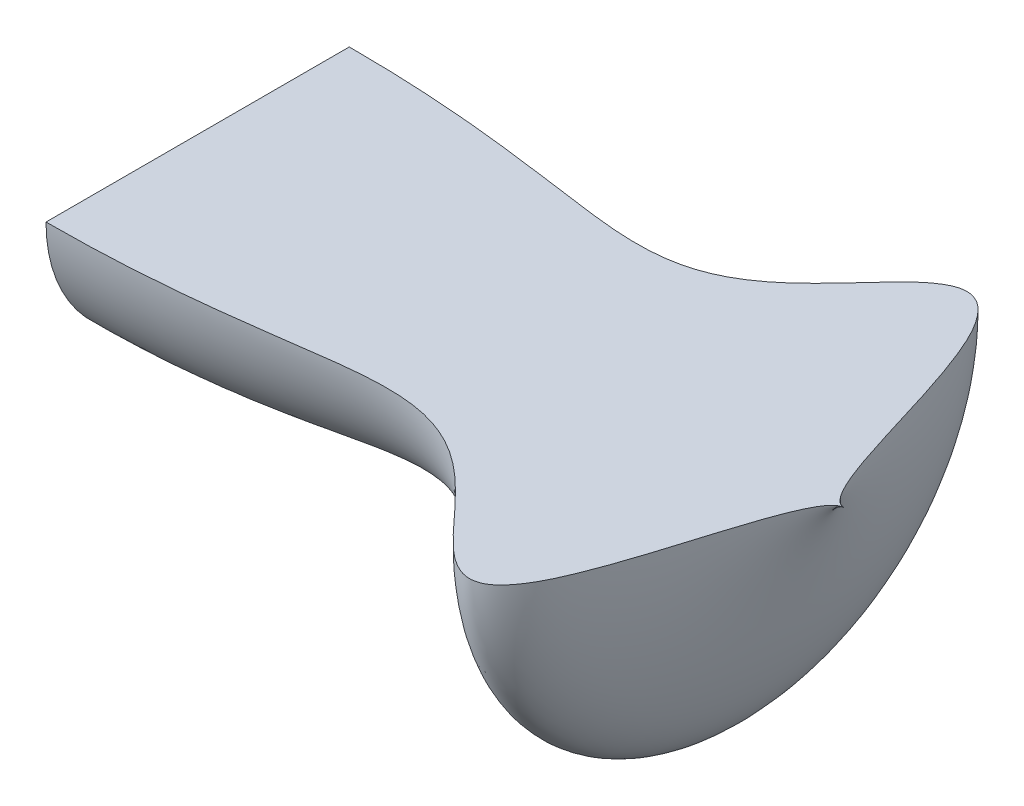
ISO-10303-21;
HEADER;
FILE_DESCRIPTION(('STEP AP214'),'2;1');
FILE_NAME('part.step','',(''),(''),'','','');
FILE_SCHEMA(('AUTOMOTIVE_DESIGN { 1 0 10303 214 1 1 1 1 }'));
ENDSEC;
DATA;
#1=APPLICATION_CONTEXT('core data for automotive mechanical design processes');
#2=APPLICATION_PROTOCOL_DEFINITION('international standard','automotive_design',2000,#1);
#3=PRODUCT_CONTEXT('',#1,'mechanical');
#4=PRODUCT('Part','Part','',(#3));
#5=PRODUCT_RELATED_PRODUCT_CATEGORY('part','',(#4));
#6=PRODUCT_DEFINITION_FORMATION('','',#4);
#7=PRODUCT_DEFINITION_CONTEXT('part definition',#1,'design');
#8=PRODUCT_DEFINITION('design','',#6,#7);
#9=PRODUCT_DEFINITION_SHAPE('','',#8);
#10=(LENGTH_UNIT() NAMED_UNIT(*) SI_UNIT(.MILLI.,.METRE.));
#11=(NAMED_UNIT(*) PLANE_ANGLE_UNIT() SI_UNIT($,.RADIAN.));
#12=(NAMED_UNIT(*) SI_UNIT($,.STERADIAN.) SOLID_ANGLE_UNIT());
#13=UNCERTAINTY_MEASURE_WITH_UNIT(LENGTH_MEASURE(1.E-05),#10,'distance_accuracy_value','');
#14=(GEOMETRIC_REPRESENTATION_CONTEXT(3) GLOBAL_UNCERTAINTY_ASSIGNED_CONTEXT((#13)) GLOBAL_UNIT_ASSIGNED_CONTEXT((#10,
#11,#12)) REPRESENTATION_CONTEXT('',''));
#15=CARTESIAN_POINT('',(0.,0.,0.));
#16=DIRECTION('',(0.,0.,1.));
#17=DIRECTION('',(1.,0.,0.));
#18=AXIS2_PLACEMENT_3D('',#15,#16,#17);
#19=CARTESIAN_POINT('',(1.82120172088159E-11,2.08863496554233E-13,-59.8208829675251));
#20=DIRECTION('',(1.,0.,0.));
#21=DIRECTION('',(0.,0.,-1.));
#22=AXIS2_PLACEMENT_3D('',#19,#20,#21);
#23=PLANE('',#22);
#24=CARTESIAN_POINT('',(1.82163768137792E-11,0.,-29.9104414837626));
#25=DIRECTION('',(-1.,0.,0.));
#26=DIRECTION('',(0.,0.,1.));
#27=AXIS2_PLACEMENT_3D('',#24,#25,#26);
#28=CIRCLE('',#27,29.9104414837626);
#29=CARTESIAN_POINT('',(1.82163768137792E-11,2.08863496554233E-13,-59.8208829675251));
#30=VERTEX_POINT('',#29);
#31=CARTESIAN_POINT('',(1.82163768137792E-11,0.,0.));
#32=VERTEX_POINT('',#31);
#33=EDGE_CURVE('E11',#30,#32,#28,.T.);
#34=ORIENTED_EDGE('',*,*,#33,.T.);
#35=DIRECTION('',(0.,0.,1.));
#36=VECTOR('',#35,1.);
#37=CARTESIAN_POINT('',(1.82163768137792E-11,2.08863496554233E-13,-59.8208829675251));
#38=LINE('',#37,#36);
#39=EDGE_CURVE('E57',#30,#32,#38,.T.);
#40=ORIENTED_EDGE('',*,*,#39,.F.);
#41=EDGE_LOOP('',(#34,#40));
#42=FACE_BOUND('',#41,.T.);
#43=ADVANCED_FACE('F35',(#42),#23,.F.);
#44=CARTESIAN_POINT('',(2.42884662782993E-11,2.08861802488339E-13,-59.8208829675251));
#45=CARTESIAN_POINT('',(1.48065472968113,2.08861802488286E-13,-59.8208829675176));
#46=CARTESIAN_POINT('',(4.34067935378938,2.08653677043719E-13,-59.7910782192792));
#47=CARTESIAN_POINT('',(11.3055800168154,2.07719607684413E-13,-59.6573141706339));
#48=CARTESIAN_POINT('',(16.837521722322,2.05214813062869E-13,-59.2986133244231));
#49=CARTESIAN_POINT('',(24.6163675378084,2.01498843274613E-13,-58.7664653007583));
#50=CARTESIAN_POINT('',(31.020816913092,1.96531543011321E-13,-58.0551196309376));
#51=CARTESIAN_POINT('',(38.222537630988,1.90546674499075E-13,-57.1980523962278));
#52=CARTESIAN_POINT('',(44.9280097403114,1.83665016250237E-13,-56.2125597670279));
#53=CARTESIAN_POINT('',(53.3414121221209,1.75590818613299E-13,-55.0562887099393));
#54=CARTESIAN_POINT('',(61.5946105162715,1.69566589654111E-13,-54.1935848352018));
#55=CARTESIAN_POINT('',(70.5241090518829,1.73696272037992E-13,-54.7849788572659));
#56=CARTESIAN_POINT('',(80.1917968770144,2.04929774662372E-13,-59.2577942031342));
#57=CARTESIAN_POINT('',(87.3419130218664,2.52548821945962E-13,-66.0771128049298));
#58=CARTESIAN_POINT('',(92.9751965340036,2.98521311048487E-13,-72.6606349035696));
#59=CARTESIAN_POINT('',(98.1713936998588,3.34430352216862E-13,-77.8030139804507));
#60=CARTESIAN_POINT('',(102.330253708239,3.44460333709804E-13,-79.2393644173493));
#61=CARTESIAN_POINT('',(105.344641886806,3.39620578867061E-13,-78.5462839776947));
#62=CARTESIAN_POINT('',(109.131661278907,3.14502285768845E-13,-74.9492014415842));
#63=CARTESIAN_POINT('',(112.646815735209,2.61638485955561E-13,-67.378804426259));
#64=CARTESIAN_POINT('',(115.441550064572,2.05431073746151E-13,-59.3295830851485));
#65=CARTESIAN_POINT('',(117.835711277436,1.48808682218724E-13,-51.2209343437825));
#66=CARTESIAN_POINT('',(119.732904205653,1.06456604079003E-13,-45.1558757011157));
#67=CARTESIAN_POINT('',(120.828829838496,0.,-41.6713258542849));
#68=CARTESIAN_POINT('',(121.852649454712,0.,-38.7233105571809));
#69=CARTESIAN_POINT('',(122.778383573465,0.,-36.2690636987515));
#70=CARTESIAN_POINT('',(123.613746139991,0.,-34.3423004170945));
#71=CARTESIAN_POINT('',(124.322222747321,0.,-32.9108655979787));
#72=CARTESIAN_POINT('',(125.010284224854,0.,-31.7343858574757));
#73=CARTESIAN_POINT('',(125.729485605069,0.,-30.8210440458678));
#74=CARTESIAN_POINT('',(126.344814548088,0.,-30.2687996588836));
#75=CARTESIAN_POINT('',(126.828881779563,0.,-30.0094308487744));
#76=CARTESIAN_POINT('',(127.212904632397,0.,-29.9243031273816));
#77=CARTESIAN_POINT('',(127.363727692227,0.,-29.910115823093));
#78=CARTESIAN_POINT('',(127.439999999251,0.,-29.9104414834581));
#79=B_SPLINE_CURVE_WITH_KNOTS('',4,(#44,#45,#46,#47,#48,#49,#50,#51,#52,#53,#54,#55,#56,#57,#58,
#59,#60,#61,#62,#63,#64,#65,#66,#67,#68,#69,#70,#71,#72,#73,#74,#75,#76,#77,#78),.UNSPECIFIED.,
.F.,.F.,(5,1,1,1,1,1,1,1,1,1,1,1,1,1,1,1,1,1,1,1,1,1,1,1,1,1,1,1,1,1,1,5),(0.0645294356402122,
0.0997103112091578,0.134891186778103,0.170072062456523,0.205252938134942,0.240433815915934,
0.275614693696927,0.310795574354269,0.345976455011612,0.410148436442966,0.445329033536919,
0.487974017775317,0.558336123165521,0.607034861867914,0.623025014447892,0.633249460423484,
0.64478753605309,0.666419875466764,0.726252213016909,0.799980767825794,0.818413197965808,
0.836845628105821,0.855278058245835,0.873710488385848,0.881764422293312,0.889818356200776,
0.89787229010824,0.905926224015704,0.90947294409435,0.913019664172997,0.91483193745182,
0.916644210720081),.UNSPECIFIED.);
#80=CARTESIAN_POINT('',(1.82076576038526E-11,0.,-29.9104414837626));
#81=DIRECTION('',(-1.,0.,0.));
#82=AXIS1_PLACEMENT('',#80,#81);
#83=SURFACE_OF_REVOLUTION('',#79,#82);
#84=CARTESIAN_POINT('',(2.42884662782993E-11,0.,0.));
#85=CARTESIAN_POINT('',(1.48065472968113,0.,-7.527515549745E-12));
#86=CARTESIAN_POINT('',(4.34067935378938,0.,-0.0298047482459689));
#87=CARTESIAN_POINT('',(11.3055800168154,0.,-0.163568796891273));
#88=CARTESIAN_POINT('',(16.837521722322,0.,-0.522269643101994));
#89=CARTESIAN_POINT('',(24.6163675378084,0.,-1.0544176667668));
#90=CARTESIAN_POINT('',(31.020816913092,0.,-1.76576333658748));
#91=CARTESIAN_POINT('',(38.222537630988,0.,-2.62283057129734));
#92=CARTESIAN_POINT('',(44.9280097403114,0.,-3.60832320049723));
#93=CARTESIAN_POINT('',(53.3414121221209,0.,-4.76459425758578));
#94=CARTESIAN_POINT('',(61.5946105162715,0.,-5.6272981323233));
#95=CARTESIAN_POINT('',(70.5241090518829,0.,-5.03590411025922));
#96=CARTESIAN_POINT('',(80.1917968770144,0.,-0.563088764390948));
#97=CARTESIAN_POINT('',(87.3419130218664,0.,6.25622983740462));
#98=CARTESIAN_POINT('',(92.9751965340036,0.,12.8397519360445));
#99=CARTESIAN_POINT('',(98.1713936998588,0.,17.9821310129256));
#100=CARTESIAN_POINT('',(102.330253708239,0.,19.4184814498241));
#101=CARTESIAN_POINT('',(105.344641886806,0.,18.7254010101696));
#102=CARTESIAN_POINT('',(109.131661278907,0.,15.1283184740591));
#103=CARTESIAN_POINT('',(112.646815735209,0.,7.55792145873384));
#104=CARTESIAN_POINT('',(115.441550064572,0.,-0.491299882376586));
#105=CARTESIAN_POINT('',(117.835711277436,0.,-8.59994862374262));
#106=CARTESIAN_POINT('',(119.732904205653,0.,-14.6650072664095));
#107=CARTESIAN_POINT('',(120.828829838496,0.,-18.1495571132402));
#108=CARTESIAN_POINT('',(121.852649454712,0.,-21.0975724103442));
#109=CARTESIAN_POINT('',(122.778383573465,0.,-23.5518192687737));
#110=CARTESIAN_POINT('',(123.613746139991,0.,-25.4785825504306));
#111=CARTESIAN_POINT('',(124.322222747321,0.,-26.9100173695464));
#112=CARTESIAN_POINT('',(125.010284224854,0.,-28.0864971100494));
#113=CARTESIAN_POINT('',(125.729485605069,0.,-28.9998389216574));
#114=CARTESIAN_POINT('',(126.344814548088,0.,-29.5520833086416));
#115=CARTESIAN_POINT('',(126.828881779563,0.,-29.8114521187508));
#116=CARTESIAN_POINT('',(127.212904632397,0.,-29.8965798401435));
#117=CARTESIAN_POINT('',(127.363727692227,0.,-29.9107671444321));
#118=CARTESIAN_POINT('',(127.439999999251,0.,-29.910441484067));
#119=B_SPLINE_CURVE_WITH_KNOTS('',4,(#84,#85,#86,#87,#88,#89,#90,#91,#92,#93,#94,#95,#96,#97,
#98,#99,#100,#101,#102,#103,#104,#105,#106,#107,#108,#109,#110,#111,#112,#113,#114,#115,#116,
#117,#118),.UNSPECIFIED.,.F.,.F.,(5,1,1,1,1,1,1,1,1,1,1,1,1,1,1,1,1,1,1,1,1,1,1,1,1,1,1,1,1,1,1,
5),(0.0645294356402122,0.0997103112091578,0.134891186778103,0.170072062456523,0.205252938134942,
0.240433815915934,0.275614693696927,0.310795574354269,0.345976455011612,0.410148436442966,
0.445329033536919,0.487974017775317,0.558336123165521,0.607034861867914,0.623025014447892,
0.633249460423484,0.64478753605309,0.666419875466764,0.726252213016909,0.799980767825794,
0.818413197965808,0.836845628105821,0.855278058245835,0.873710488385848,0.881764422293312,
0.889818356200776,0.89787229010824,0.905926224015704,0.90947294409435,0.913019664172997,
0.91483193745182,0.916644210720081),.UNSPECIFIED.);
#120=CARTESIAN_POINT('',(127.439999997954,0.,-29.9104414837626));
#121=VERTEX_POINT('',#120);
#122=EDGE_CURVE('E50',#32,#121,#119,.T.);
#123=ORIENTED_EDGE('',*,*,#122,.F.);
#124=ORIENTED_EDGE('',*,*,#33,.F.);
#125=EDGE_CURVE('E43',#30,#121,#79,.T.);
#126=ORIENTED_EDGE('',*,*,#125,.T.);
#127=EDGE_LOOP('',(#123,#124,#126));
#128=FACE_BOUND('',#127,.T.);
#129=ADVANCED_FACE('F37',(#128),#83,.F.);
#130=CARTESIAN_POINT('',(0.,2.08863496554233E-13,-59.8208829675251));
#131=DIRECTION('',(0.,-1.,0.));
#132=DIRECTION('',(0.,0.,-1.));
#133=AXIS2_PLACEMENT_3D('',#130,#131,#132);
#134=PLANE('',#133);
#135=ORIENTED_EDGE('',*,*,#39,.T.);
#136=ORIENTED_EDGE('',*,*,#122,.T.);
#137=ORIENTED_EDGE('',*,*,#125,.F.);
#138=EDGE_LOOP('',(#135,#136,#137));
#139=FACE_BOUND('',#138,.T.);
#140=ADVANCED_FACE('F58',(#139),#134,.F.);
#141=CLOSED_SHELL('',(#43,#129,#140));
#142=MANIFOLD_SOLID_BREP('B2',#141);
#143=ADVANCED_BREP_SHAPE_REPRESENTATION('',(#18,#142),#14);
#144=SHAPE_DEFINITION_REPRESENTATION(#9,#143);
ENDSEC;
END-ISO-10303-21;
